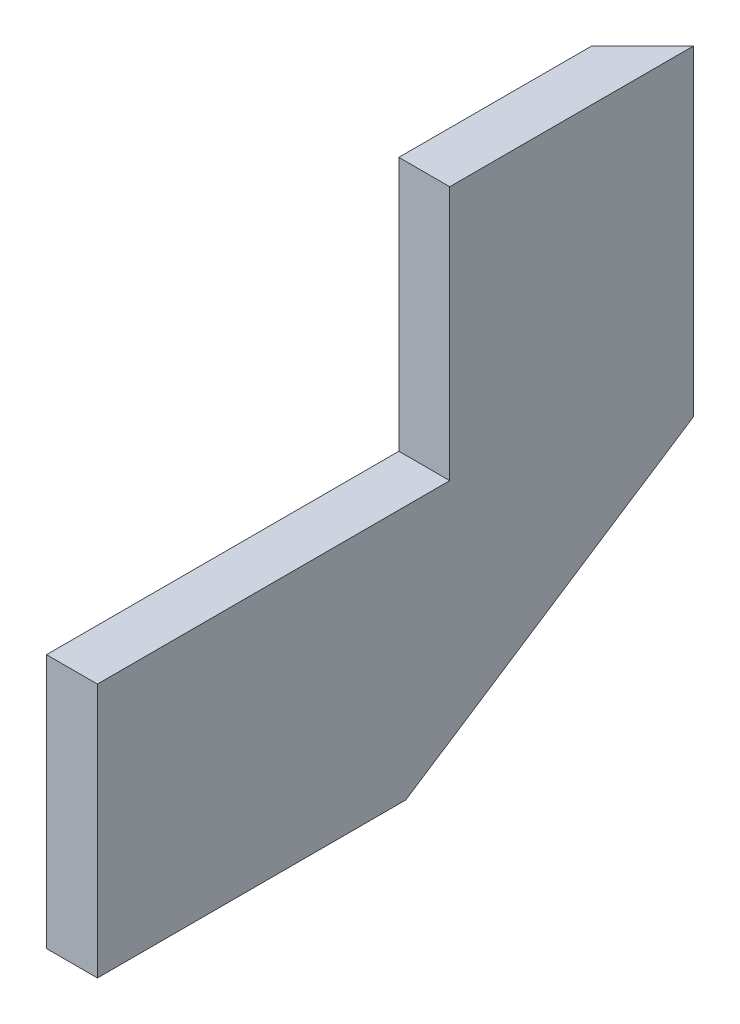
ISO-10303-21;
HEADER;
FILE_DESCRIPTION(('STEP AP214'),'2;1');
FILE_NAME('part.step','',(''),(''),'','','');
FILE_SCHEMA(('AUTOMOTIVE_DESIGN { 1 0 10303 214 1 1 1 1 }'));
ENDSEC;
DATA;
#1=APPLICATION_CONTEXT('core data for automotive mechanical design processes');
#2=APPLICATION_PROTOCOL_DEFINITION('international standard','automotive_design',2000,#1);
#3=PRODUCT_CONTEXT('',#1,'mechanical');
#4=PRODUCT('Part','Part','',(#3));
#5=PRODUCT_RELATED_PRODUCT_CATEGORY('part','',(#4));
#6=PRODUCT_DEFINITION_FORMATION('','',#4);
#7=PRODUCT_DEFINITION_CONTEXT('part definition',#1,'design');
#8=PRODUCT_DEFINITION('design','',#6,#7);
#9=PRODUCT_DEFINITION_SHAPE('','',#8);
#10=(LENGTH_UNIT() NAMED_UNIT(*) SI_UNIT(.MILLI.,.METRE.));
#11=(NAMED_UNIT(*) PLANE_ANGLE_UNIT() SI_UNIT($,.RADIAN.));
#12=(NAMED_UNIT(*) SI_UNIT($,.STERADIAN.) SOLID_ANGLE_UNIT());
#13=UNCERTAINTY_MEASURE_WITH_UNIT(LENGTH_MEASURE(1.E-05),#10,'distance_accuracy_value','');
#14=(GEOMETRIC_REPRESENTATION_CONTEXT(3) GLOBAL_UNCERTAINTY_ASSIGNED_CONTEXT((#13)) GLOBAL_UNIT_ASSIGNED_CONTEXT((#10,
#11,#12)) REPRESENTATION_CONTEXT('',''));
#15=CARTESIAN_POINT('',(0.,0.,0.));
#16=DIRECTION('',(0.,0.,1.));
#17=DIRECTION('',(1.,0.,0.));
#18=AXIS2_PLACEMENT_3D('',#15,#16,#17);
#19=CARTESIAN_POINT('',(38.1,0.,0.));
#20=DIRECTION('',(0.,0.,1.));
#21=DIRECTION('',(1.,0.,0.));
#22=AXIS2_PLACEMENT_3D('',#19,#20,#21);
#23=PLANE('',#22);
#24=DIRECTION('',(0.,1.,0.));
#25=VECTOR('',#24,1.);
#26=CARTESIAN_POINT('',(0.,0.,0.));
#27=LINE('',#26,#25);
#28=CARTESIAN_POINT('',(0.,0.,0.));
#29=VERTEX_POINT('',#28);
#30=CARTESIAN_POINT('',(0.,190.5,0.));
#31=VERTEX_POINT('',#30);
#32=EDGE_CURVE('E123',#29,#31,#27,.T.);
#33=ORIENTED_EDGE('',*,*,#32,.F.);
#34=DIRECTION('',(-1.,0.,0.));
#35=VECTOR('',#34,1.);
#36=CARTESIAN_POINT('',(38.1,0.,0.));
#37=LINE('',#36,#35);
#38=CARTESIAN_POINT('',(38.1,0.,0.));
#39=VERTEX_POINT('',#38);
#40=EDGE_CURVE('E11',#39,#29,#37,.T.);
#41=ORIENTED_EDGE('',*,*,#40,.F.);
#42=DIRECTION('',(0.,1.,0.));
#43=VECTOR('',#42,1.);
#44=CARTESIAN_POINT('',(38.1,0.,0.));
#45=LINE('',#44,#43);
#46=CARTESIAN_POINT('',(38.1,190.5,0.));
#47=VERTEX_POINT('',#46);
#48=EDGE_CURVE('E137',#39,#47,#45,.T.);
#49=ORIENTED_EDGE('',*,*,#48,.T.);
#50=DIRECTION('',(-1.,0.,0.));
#51=VECTOR('',#50,1.);
#52=CARTESIAN_POINT('',(38.1,190.5,0.));
#53=LINE('',#52,#51);
#54=EDGE_CURVE('E58',#47,#31,#53,.T.);
#55=ORIENTED_EDGE('',*,*,#54,.T.);
#56=EDGE_LOOP('',(#33,#41,#49,#55));
#57=FACE_BOUND('',#56,.T.);
#58=ADVANCED_FACE('F35',(#57),#23,.T.);
#59=CARTESIAN_POINT('',(38.1,0.,0.));
#60=DIRECTION('',(0.,1.,0.));
#61=DIRECTION('',(0.,0.,1.));
#62=AXIS2_PLACEMENT_3D('',#59,#60,#61);
#63=PLANE('',#62);
#64=DIRECTION('',(0.,0.,-1.));
#65=VECTOR('',#64,1.);
#66=CARTESIAN_POINT('',(0.,0.,0.));
#67=LINE('',#66,#65);
#68=CARTESIAN_POINT('',(0.,0.,-230.79012683886));
#69=VERTEX_POINT('',#68);
#70=EDGE_CURVE('E125',#29,#69,#67,.T.);
#71=ORIENTED_EDGE('',*,*,#70,.T.);
#72=DIRECTION('',(-1.,0.,0.));
#73=VECTOR('',#72,1.);
#74=CARTESIAN_POINT('',(38.1,0.,-230.79012683886));
#75=LINE('',#74,#73);
#76=CARTESIAN_POINT('',(38.1,0.,-230.79012683886));
#77=VERTEX_POINT('',#76);
#78=EDGE_CURVE('E42',#77,#69,#75,.T.);
#79=ORIENTED_EDGE('',*,*,#78,.F.);
#80=DIRECTION('',(0.,0.,-1.));
#81=VECTOR('',#80,1.);
#82=CARTESIAN_POINT('',(38.1,0.,0.));
#83=LINE('',#82,#81);
#84=EDGE_CURVE('E158',#39,#77,#83,.T.);
#85=ORIENTED_EDGE('',*,*,#84,.F.);
#86=ORIENTED_EDGE('',*,*,#40,.T.);
#87=EDGE_LOOP('',(#71,#79,#85,#86));
#88=FACE_BOUND('',#87,.T.);
#89=ADVANCED_FACE('F161',(#88),#63,.F.);
#90=CARTESIAN_POINT('',(38.1,-105.716899889716,-69.1353861693452));
#91=DIRECTION('',(0.,0.836923205322502,0.547320334349739));
#92=DIRECTION('',(0.,-0.547320334349739,0.836923205322502));
#93=AXIS2_PLACEMENT_3D('',#90,#91,#92);
#94=PLANE('',#93);
#95=DIRECTION('',(0.,0.547320334349739,-0.836923205322502));
#96=VECTOR('',#95,1.);
#97=CARTESIAN_POINT('',(0.,-105.716899889716,-69.1353861693452));
#98=LINE('',#97,#96);
#99=CARTESIAN_POINT('',(0.,115.861676912361,-407.957536726414));
#100=VERTEX_POINT('',#99);
#101=EDGE_CURVE('E128',#69,#100,#98,.T.);
#102=ORIENTED_EDGE('',*,*,#101,.T.);
#103=DIRECTION('',(-0.641807659510565,-0.419721165045472,0.641807659510575));
#104=VECTOR('',#103,1.);
#105=CARTESIAN_POINT('',(0.176963004661905,115.977404914958,-408.134499731076));
#106=LINE('',#105,#104);
#107=CARTESIAN_POINT('',(38.1,140.777827648903,-446.057536726415));
#108=VERTEX_POINT('',#107);
#109=EDGE_CURVE('E49',#108,#100,#106,.T.);
#110=ORIENTED_EDGE('',*,*,#109,.F.);
#111=DIRECTION('',(0.,0.547320334349739,-0.836923205322502));
#112=VECTOR('',#111,1.);
#113=CARTESIAN_POINT('',(38.1,-105.716899889716,-69.1353861693452));
#114=LINE('',#113,#112);
#115=EDGE_CURVE('E145',#77,#108,#114,.T.);
#116=ORIENTED_EDGE('',*,*,#115,.F.);
#117=ORIENTED_EDGE('',*,*,#78,.T.);
#118=EDGE_LOOP('',(#102,#110,#116,#117));
#119=FACE_BOUND('',#118,.T.);
#120=ADVANCED_FACE('F144',(#119),#94,.F.);
#121=CARTESIAN_POINT('',(38.1,381.,0.));
#122=DIRECTION('',(0.,1.,0.));
#123=DIRECTION('',(0.,0.,1.));
#124=AXIS2_PLACEMENT_3D('',#121,#122,#123);
#125=PLANE('',#124);
#126=DIRECTION('',(0.707106781186542,0.,-0.707106781186553));
#127=VECTOR('',#126,1.);
#128=CARTESIAN_POINT('',(38.1,381.,-446.057536726415));
#129=LINE('',#128,#127);
#130=CARTESIAN_POINT('',(0.,381.,-407.957536726414));
#131=VERTEX_POINT('',#130);
#132=CARTESIAN_POINT('',(38.1,381.,-446.057536726415));
#133=VERTEX_POINT('',#132);
#134=EDGE_CURVE('E152',#131,#133,#129,.T.);
#135=ORIENTED_EDGE('',*,*,#134,.F.);
#136=DIRECTION('',(0.,0.,-1.));
#137=VECTOR('',#136,1.);
#138=CARTESIAN_POINT('',(0.,381.,0.));
#139=LINE('',#138,#137);
#140=CARTESIAN_POINT('',(0.,381.,-263.652));
#141=VERTEX_POINT('',#140);
#142=EDGE_CURVE('E100',#141,#131,#139,.T.);
#143=ORIENTED_EDGE('',*,*,#142,.F.);
#144=DIRECTION('',(-1.,0.,0.));
#145=VECTOR('',#144,1.);
#146=CARTESIAN_POINT('',(38.1,381.,-263.652));
#147=LINE('',#146,#145);
#148=CARTESIAN_POINT('',(38.1,381.,-263.652));
#149=VERTEX_POINT('',#148);
#150=EDGE_CURVE('E93',#149,#141,#147,.T.);
#151=ORIENTED_EDGE('',*,*,#150,.F.);
#152=DIRECTION('',(0.,0.,-1.));
#153=VECTOR('',#152,1.);
#154=CARTESIAN_POINT('',(38.1,381.,0.));
#155=LINE('',#154,#153);
#156=EDGE_CURVE('E98',#149,#133,#155,.T.);
#157=ORIENTED_EDGE('',*,*,#156,.T.);
#158=EDGE_LOOP('',(#135,#143,#151,#157));
#159=FACE_BOUND('',#158,.T.);
#160=ADVANCED_FACE('F96',(#159),#125,.T.);
#161=CARTESIAN_POINT('',(38.1,0.,-263.652));
#162=DIRECTION('',(0.,0.,1.));
#163=DIRECTION('',(1.,0.,0.));
#164=AXIS2_PLACEMENT_3D('',#161,#162,#163);
#165=PLANE('',#164);
#166=DIRECTION('',(0.,1.,0.));
#167=VECTOR('',#166,1.);
#168=CARTESIAN_POINT('',(0.,0.,-263.652));
#169=LINE('',#168,#167);
#170=CARTESIAN_POINT('',(0.,190.5,-263.652));
#171=VERTEX_POINT('',#170);
#172=EDGE_CURVE('E132',#171,#141,#169,.T.);
#173=ORIENTED_EDGE('',*,*,#172,.F.);
#174=DIRECTION('',(-1.,0.,0.));
#175=VECTOR('',#174,1.);
#176=CARTESIAN_POINT('',(38.1,190.5,-263.652));
#177=LINE('',#176,#175);
#178=CARTESIAN_POINT('',(38.1,190.5,-263.652));
#179=VERTEX_POINT('',#178);
#180=EDGE_CURVE('E105',#179,#171,#177,.T.);
#181=ORIENTED_EDGE('',*,*,#180,.F.);
#182=DIRECTION('',(0.,1.,0.));
#183=VECTOR('',#182,1.);
#184=CARTESIAN_POINT('',(38.1,0.,-263.652));
#185=LINE('',#184,#183);
#186=EDGE_CURVE('E113',#179,#149,#185,.T.);
#187=ORIENTED_EDGE('',*,*,#186,.T.);
#188=ORIENTED_EDGE('',*,*,#150,.T.);
#189=EDGE_LOOP('',(#173,#181,#187,#188));
#190=FACE_BOUND('',#189,.T.);
#191=ADVANCED_FACE('F117',(#190),#165,.T.);
#192=CARTESIAN_POINT('',(38.1,190.5,0.));
#193=DIRECTION('',(0.,1.,0.));
#194=DIRECTION('',(0.,0.,1.));
#195=AXIS2_PLACEMENT_3D('',#192,#193,#194);
#196=PLANE('',#195);
#197=DIRECTION('',(0.,0.,-1.));
#198=VECTOR('',#197,1.);
#199=CARTESIAN_POINT('',(0.,190.5,0.));
#200=LINE('',#199,#198);
#201=EDGE_CURVE('E134',#31,#171,#200,.T.);
#202=ORIENTED_EDGE('',*,*,#201,.F.);
#203=ORIENTED_EDGE('',*,*,#54,.F.);
#204=DIRECTION('',(0.,0.,-1.));
#205=VECTOR('',#204,1.);
#206=CARTESIAN_POINT('',(38.1,190.5,0.));
#207=LINE('',#206,#205);
#208=EDGE_CURVE('E118',#47,#179,#207,.T.);
#209=ORIENTED_EDGE('',*,*,#208,.T.);
#210=ORIENTED_EDGE('',*,*,#180,.T.);
#211=EDGE_LOOP('',(#202,#203,#209,#210));
#212=FACE_BOUND('',#211,.T.);
#213=ADVANCED_FACE('F173',(#212),#196,.T.);
#214=CARTESIAN_POINT('',(38.1,0.,0.));
#215=DIRECTION('',(1.,0.,0.));
#216=DIRECTION('',(0.,0.,-1.));
#217=AXIS2_PLACEMENT_3D('',#214,#215,#216);
#218=PLANE('',#217);
#219=ORIENTED_EDGE('',*,*,#48,.F.);
#220=ORIENTED_EDGE('',*,*,#84,.T.);
#221=ORIENTED_EDGE('',*,*,#115,.T.);
#222=DIRECTION('',(0.,-1.,0.));
#223=VECTOR('',#222,1.);
#224=CARTESIAN_POINT('',(38.1,1.03076111321118E-13,-446.057536726415));
#225=LINE('',#224,#223);
#226=EDGE_CURVE('E115',#133,#108,#225,.T.);
#227=ORIENTED_EDGE('',*,*,#226,.F.);
#228=ORIENTED_EDGE('',*,*,#156,.F.);
#229=ORIENTED_EDGE('',*,*,#186,.F.);
#230=ORIENTED_EDGE('',*,*,#208,.F.);
#231=EDGE_LOOP('',(#219,#220,#221,#227,#228,#229,#230));
#232=FACE_BOUND('',#231,.T.);
#233=ADVANCED_FACE('F111',(#232),#218,.T.);
#234=CARTESIAN_POINT('',(0.,0.,0.));
#235=DIRECTION('',(1.,0.,0.));
#236=DIRECTION('',(0.,0.,-1.));
#237=AXIS2_PLACEMENT_3D('',#234,#235,#236);
#238=PLANE('',#237);
#239=ORIENTED_EDGE('',*,*,#142,.T.);
#240=DIRECTION('',(0.,1.,0.));
#241=VECTOR('',#240,1.);
#242=CARTESIAN_POINT('',(0.,-0.00100000000002876,-407.957536726414));
#243=LINE('',#242,#241);
#244=EDGE_CURVE('E126',#100,#131,#243,.T.);
#245=ORIENTED_EDGE('',*,*,#244,.F.);
#246=ORIENTED_EDGE('',*,*,#101,.F.);
#247=ORIENTED_EDGE('',*,*,#70,.F.);
#248=ORIENTED_EDGE('',*,*,#32,.T.);
#249=ORIENTED_EDGE('',*,*,#201,.T.);
#250=ORIENTED_EDGE('',*,*,#172,.T.);
#251=EDGE_LOOP('',(#239,#245,#246,#247,#248,#249,#250));
#252=FACE_BOUND('',#251,.T.);
#253=ADVANCED_FACE('F149',(#252),#238,.F.);
#254=CARTESIAN_POINT('',(38.1,-0.00100000000002876,-446.057536726415));
#255=DIRECTION('',(0.707106781186553,0.,0.707106781186542));
#256=DIRECTION('',(0.707106781186542,0.,-0.707106781186553));
#257=AXIS2_PLACEMENT_3D('',#254,#255,#256);
#258=PLANE('',#257);
#259=ORIENTED_EDGE('',*,*,#109,.T.);
#260=ORIENTED_EDGE('',*,*,#244,.T.);
#261=ORIENTED_EDGE('',*,*,#134,.T.);
#262=ORIENTED_EDGE('',*,*,#226,.T.);
#263=EDGE_LOOP('',(#259,#260,#261,#262));
#264=FACE_BOUND('',#263,.T.);
#265=ADVANCED_FACE('F160',(#264),#258,.F.);
#266=CLOSED_SHELL('',(#58,#89,#120,#160,#191,#213,#233,#253,#265));
#267=MANIFOLD_SOLID_BREP('B2',#266);
#268=ADVANCED_BREP_SHAPE_REPRESENTATION('',(#18,#267),#14);
#269=SHAPE_DEFINITION_REPRESENTATION(#9,#268);
ENDSEC;
END-ISO-10303-21;
